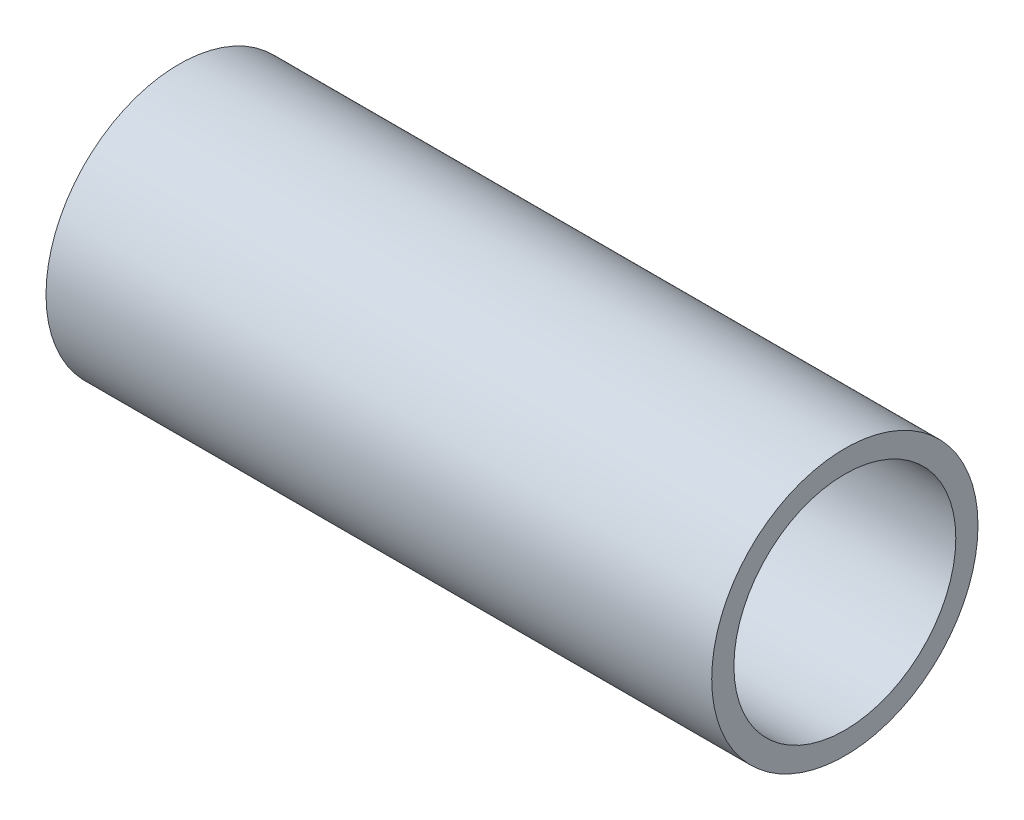
ISO-10303-21;
HEADER;
FILE_DESCRIPTION(('STEP AP214'),'2;1');
FILE_NAME('part.step','',(''),(''),'','','');
FILE_SCHEMA(('AUTOMOTIVE_DESIGN { 1 0 10303 214 1 1 1 1 }'));
ENDSEC;
DATA;
#1=APPLICATION_CONTEXT('core data for automotive mechanical design processes');
#2=APPLICATION_PROTOCOL_DEFINITION('international standard','automotive_design',2000,#1);
#3=PRODUCT_CONTEXT('',#1,'mechanical');
#4=PRODUCT('Part','Part','',(#3));
#5=PRODUCT_RELATED_PRODUCT_CATEGORY('part','',(#4));
#6=PRODUCT_DEFINITION_FORMATION('','',#4);
#7=PRODUCT_DEFINITION_CONTEXT('part definition',#1,'design');
#8=PRODUCT_DEFINITION('design','',#6,#7);
#9=PRODUCT_DEFINITION_SHAPE('','',#8);
#10=(LENGTH_UNIT() NAMED_UNIT(*) SI_UNIT(.MILLI.,.METRE.));
#11=(NAMED_UNIT(*) PLANE_ANGLE_UNIT() SI_UNIT($,.RADIAN.));
#12=(NAMED_UNIT(*) SI_UNIT($,.STERADIAN.) SOLID_ANGLE_UNIT());
#13=UNCERTAINTY_MEASURE_WITH_UNIT(LENGTH_MEASURE(1.E-05),#10,'distance_accuracy_value','');
#14=(GEOMETRIC_REPRESENTATION_CONTEXT(3) GLOBAL_UNCERTAINTY_ASSIGNED_CONTEXT((#13)) GLOBAL_UNIT_ASSIGNED_CONTEXT((#10,
#11,#12)) REPRESENTATION_CONTEXT('',''));
#15=CARTESIAN_POINT('',(0.,0.,0.));
#16=DIRECTION('',(0.,0.,1.));
#17=DIRECTION('',(1.,0.,0.));
#18=AXIS2_PLACEMENT_3D('',#15,#16,#17);
#19=CARTESIAN_POINT('',(-8.72112303644637,0.,0.));
#20=DIRECTION('',(1.,0.,0.));
#21=DIRECTION('',(0.,0.,-1.));
#22=AXIS2_PLACEMENT_3D('',#19,#20,#21);
#23=PLANE('',#22);
#24=CARTESIAN_POINT('',(-8.72112303644637,0.,0.));
#25=DIRECTION('',(-1.,0.,0.));
#26=DIRECTION('',(0.,0.,1.));
#27=AXIS2_PLACEMENT_3D('',#24,#25,#26);
#28=CIRCLE('',#27,3.);
#29=CARTESIAN_POINT('',(-8.72112303644637,0.,3.));
#30=VERTEX_POINT('',#29);
#31=EDGE_CURVE('E10',#30,#30,#28,.T.);
#32=ORIENTED_EDGE('',*,*,#31,.T.);
#33=EDGE_LOOP('',(#32));
#34=FACE_BOUND('',#33,.T.);
#35=ADVANCED_FACE('F37',(#34),#23,.F.);
#36=CARTESIAN_POINT('',(-26.9135802469136,0.,0.));
#37=DIRECTION('',(-1.,0.,0.));
#38=DIRECTION('',(0.,0.,1.));
#39=AXIS2_PLACEMENT_3D('',#36,#37,#38);
#40=CYLINDRICAL_SURFACE('',#39,3.);
#41=ORIENTED_EDGE('',*,*,#31,.F.);
#42=EDGE_LOOP('',(#41));
#43=FACE_BOUND('',#42,.T.);
#44=CARTESIAN_POINT('',(6.27887696355363,0.,0.));
#45=DIRECTION('',(-1.,0.,0.));
#46=DIRECTION('',(0.,0.,1.));
#47=AXIS2_PLACEMENT_3D('',#44,#45,#46);
#48=CIRCLE('',#47,3.);
#49=CARTESIAN_POINT('',(6.27887696355363,0.,3.));
#50=VERTEX_POINT('',#49);
#51=EDGE_CURVE('E44',#50,#50,#48,.T.);
#52=ORIENTED_EDGE('',*,*,#51,.T.);
#53=EDGE_LOOP('',(#52));
#54=FACE_BOUND('',#53,.T.);
#55=ADVANCED_FACE('F73',(#43,#54),#40,.T.);
#56=CARTESIAN_POINT('',(6.27887696355363,0.,-3.));
#57=DIRECTION('',(-1.,0.,0.));
#58=DIRECTION('',(0.,0.,1.));
#59=AXIS2_PLACEMENT_3D('',#56,#57,#58);
#60=PLANE('',#59);
#61=ORIENTED_EDGE('',*,*,#51,.F.);
#62=EDGE_LOOP('',(#61));
#63=FACE_BOUND('',#62,.T.);
#64=CARTESIAN_POINT('',(6.27887696355363,0.,0.));
#65=DIRECTION('',(-1.,0.,0.));
#66=DIRECTION('',(0.,0.,1.));
#67=AXIS2_PLACEMENT_3D('',#64,#65,#66);
#68=CIRCLE('',#67,2.5);
#69=CARTESIAN_POINT('',(6.27887696355363,0.,2.5));
#70=VERTEX_POINT('',#69);
#71=EDGE_CURVE('E49',#70,#70,#68,.T.);
#72=ORIENTED_EDGE('',*,*,#71,.T.);
#73=EDGE_LOOP('',(#72));
#74=FACE_BOUND('',#73,.T.);
#75=ADVANCED_FACE('F69',(#63,#74),#60,.F.);
#76=CARTESIAN_POINT('',(-26.9135802469136,0.,0.));
#77=DIRECTION('',(-1.,0.,0.));
#78=DIRECTION('',(0.,0.,1.));
#79=AXIS2_PLACEMENT_3D('',#76,#77,#78);
#80=CYLINDRICAL_SURFACE('',#79,2.5);
#81=ORIENTED_EDGE('',*,*,#71,.F.);
#82=EDGE_LOOP('',(#81));
#83=FACE_BOUND('',#82,.T.);
#84=CARTESIAN_POINT('',(1.27887696355363,0.,0.));
#85=DIRECTION('',(-1.,0.,0.));
#86=DIRECTION('',(0.,0.,1.));
#87=AXIS2_PLACEMENT_3D('',#84,#85,#86);
#88=CIRCLE('',#87,2.5);
#89=CARTESIAN_POINT('',(1.27887696355363,0.,2.5));
#90=VERTEX_POINT('',#89);
#91=EDGE_CURVE('E54',#90,#90,#88,.T.);
#92=ORIENTED_EDGE('',*,*,#91,.T.);
#93=EDGE_LOOP('',(#92));
#94=FACE_BOUND('',#93,.T.);
#95=ADVANCED_FACE('F61',(#83,#94),#80,.F.);
#96=CARTESIAN_POINT('',(1.27887696355363,0.,-2.5));
#97=DIRECTION('',(-1.,0.,0.));
#98=DIRECTION('',(0.,0.,1.));
#99=AXIS2_PLACEMENT_3D('',#96,#97,#98);
#100=PLANE('',#99);
#101=ORIENTED_EDGE('',*,*,#91,.F.);
#102=EDGE_LOOP('',(#101));
#103=FACE_BOUND('',#102,.T.);
#104=ADVANCED_FACE('F63',(#103),#100,.F.);
#105=CLOSED_SHELL('',(#35,#55,#75,#95,#104));
#106=MANIFOLD_SOLID_BREP('B2',#105);
#107=ADVANCED_BREP_SHAPE_REPRESENTATION('',(#18,#106),#14);
#108=SHAPE_DEFINITION_REPRESENTATION(#9,#107);
ENDSEC;
END-ISO-10303-21;
